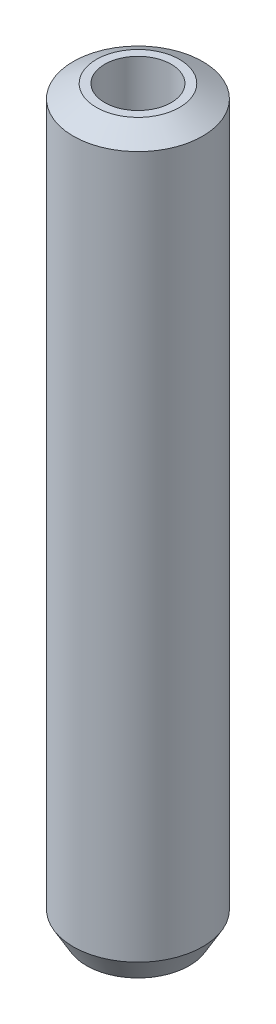
ISO-10303-21;
HEADER;
FILE_DESCRIPTION(('STEP AP214'),'2;1');
FILE_NAME('part.step','',(''),(''),'','','');
FILE_SCHEMA(('AUTOMOTIVE_DESIGN { 1 0 10303 214 1 1 1 1 }'));
ENDSEC;
DATA;
#1=APPLICATION_CONTEXT('core data for automotive mechanical design processes');
#2=APPLICATION_PROTOCOL_DEFINITION('international standard','automotive_design',2000,#1);
#3=PRODUCT_CONTEXT('',#1,'mechanical');
#4=PRODUCT('Part','Part','',(#3));
#5=PRODUCT_RELATED_PRODUCT_CATEGORY('part','',(#4));
#6=PRODUCT_DEFINITION_FORMATION('','',#4);
#7=PRODUCT_DEFINITION_CONTEXT('part definition',#1,'design');
#8=PRODUCT_DEFINITION('design','',#6,#7);
#9=PRODUCT_DEFINITION_SHAPE('','',#8);
#10=(LENGTH_UNIT() NAMED_UNIT(*) SI_UNIT(.MILLI.,.METRE.));
#11=(NAMED_UNIT(*) PLANE_ANGLE_UNIT() SI_UNIT($,.RADIAN.));
#12=(NAMED_UNIT(*) SI_UNIT($,.STERADIAN.) SOLID_ANGLE_UNIT());
#13=UNCERTAINTY_MEASURE_WITH_UNIT(LENGTH_MEASURE(1.E-05),#10,'distance_accuracy_value','');
#14=(GEOMETRIC_REPRESENTATION_CONTEXT(3) GLOBAL_UNCERTAINTY_ASSIGNED_CONTEXT((#13)) GLOBAL_UNIT_ASSIGNED_CONTEXT((#10,
#11,#12)) REPRESENTATION_CONTEXT('',''));
#15=CARTESIAN_POINT('',(0.,0.,0.));
#16=DIRECTION('',(0.,0.,1.));
#17=DIRECTION('',(1.,0.,0.));
#18=AXIS2_PLACEMENT_3D('',#15,#16,#17);
#19=CARTESIAN_POINT('',(0.,228.270910418052,0.));
#20=DIRECTION('',(0.,-1.,0.));
#21=DIRECTION('',(0.,0.,-1.));
#22=AXIS2_PLACEMENT_3D('',#19,#20,#21);
#23=CYLINDRICAL_SURFACE('',#22,20.);
#24=CARTESIAN_POINT('',(0.,224.149492364011,0.));
#25=DIRECTION('',(0.,1.,0.));
#26=DIRECTION('',(0.,0.,1.));
#27=AXIS2_PLACEMENT_3D('',#24,#25,#26);
#28=CIRCLE('',#27,20.);
#29=CARTESIAN_POINT('',(0.,224.149492364011,20.));
#30=VERTEX_POINT('',#29);
#31=EDGE_CURVE('E50',#30,#30,#28,.F.);
#32=ORIENTED_EDGE('',*,*,#31,.T.);
#33=EDGE_LOOP('',(#32));
#34=FACE_BOUND('',#33,.T.);
#35=CARTESIAN_POINT('',(0.,7.13850546883116,0.));
#36=DIRECTION('',(0.,1.,0.));
#37=DIRECTION('',(0.,0.,1.));
#38=AXIS2_PLACEMENT_3D('',#35,#36,#37);
#39=CIRCLE('',#38,20.);
#40=CARTESIAN_POINT('',(0.,7.13850546883116,20.));
#41=VERTEX_POINT('',#40);
#42=EDGE_CURVE('E51',#41,#41,#39,.T.);
#43=ORIENTED_EDGE('',*,*,#42,.T.);
#44=EDGE_LOOP('',(#43));
#45=FACE_BOUND('',#44,.T.);
#46=ADVANCED_FACE('F39',(#34,#45),#23,.T.);
#47=CARTESIAN_POINT('',(0.,228.270910418052,0.));
#48=DIRECTION('',(0.,1.,0.));
#49=DIRECTION('',(0.,0.,1.));
#50=AXIS2_PLACEMENT_3D('',#47,#48,#49);
#51=PLANE('',#50);
#52=CARTESIAN_POINT('',(0.,228.270910418052,0.));
#53=DIRECTION('',(0.,1.,0.));
#54=DIRECTION('',(0.,0.,1.));
#55=AXIS2_PLACEMENT_3D('',#52,#53,#54);
#56=CIRCLE('',#55,12.8614945311689);
#57=CARTESIAN_POINT('',(0.,228.270910418052,12.8614945311689));
#58=VERTEX_POINT('',#57);
#59=EDGE_CURVE('E54',#58,#58,#56,.T.);
#60=ORIENTED_EDGE('',*,*,#59,.T.);
#61=EDGE_LOOP('',(#60));
#62=FACE_BOUND('',#61,.T.);
#63=CARTESIAN_POINT('',(0.,228.270910418052,0.));
#64=DIRECTION('',(0.,1.,0.));
#65=DIRECTION('',(0.,0.,1.));
#66=AXIS2_PLACEMENT_3D('',#63,#64,#65);
#67=CIRCLE('',#66,10.2807044307122);
#68=CARTESIAN_POINT('',(0.,228.270910418052,10.2807044307122));
#69=VERTEX_POINT('',#68);
#70=EDGE_CURVE('E58',#69,#69,#67,.T.);
#71=ORIENTED_EDGE('',*,*,#70,.F.);
#72=EDGE_LOOP('',(#71));
#73=FACE_BOUND('',#72,.T.);
#74=ADVANCED_FACE('F69',(#62,#73),#51,.T.);
#75=CARTESIAN_POINT('',(0.,0.,0.));
#76=DIRECTION('',(0.,1.,0.));
#77=DIRECTION('',(0.,0.,1.));
#78=AXIS2_PLACEMENT_3D('',#75,#76,#77);
#79=PLANE('',#78);
#80=CARTESIAN_POINT('',(0.,0.,0.));
#81=DIRECTION('',(0.,1.,0.));
#82=DIRECTION('',(0.,0.,1.));
#83=AXIS2_PLACEMENT_3D('',#80,#81,#82);
#84=CIRCLE('',#83,15.8785819459587);
#85=CARTESIAN_POINT('',(0.,0.,15.8785819459587));
#86=VERTEX_POINT('',#85);
#87=EDGE_CURVE('E10',#86,#86,#84,.F.);
#88=ORIENTED_EDGE('',*,*,#87,.T.);
#89=EDGE_LOOP('',(#88));
#90=FACE_BOUND('',#89,.T.);
#91=CARTESIAN_POINT('',(0.,0.,0.));
#92=DIRECTION('',(0.,1.,0.));
#93=DIRECTION('',(0.,0.,1.));
#94=AXIS2_PLACEMENT_3D('',#91,#92,#93);
#95=CIRCLE('',#94,10.2807044307122);
#96=CARTESIAN_POINT('',(0.,0.,10.2807044307122));
#97=VERTEX_POINT('',#96);
#98=EDGE_CURVE('E63',#97,#97,#95,.T.);
#99=ORIENTED_EDGE('',*,*,#98,.T.);
#100=EDGE_LOOP('',(#99));
#101=FACE_BOUND('',#100,.T.);
#102=ADVANCED_FACE('F75',(#90,#101),#79,.F.);
#103=CARTESIAN_POINT('',(0.,228.270910418052,0.));
#104=DIRECTION('',(0.,-1.,0.));
#105=DIRECTION('',(0.,0.,-1.));
#106=AXIS2_PLACEMENT_3D('',#103,#104,#105);
#107=CYLINDRICAL_SURFACE('',#106,10.2807044307122);
#108=ORIENTED_EDGE('',*,*,#70,.T.);
#109=EDGE_LOOP('',(#108));
#110=FACE_BOUND('',#109,.T.);
#111=ORIENTED_EDGE('',*,*,#98,.F.);
#112=EDGE_LOOP('',(#111));
#113=FACE_BOUND('',#112,.T.);
#114=ADVANCED_FACE('F70',(#110,#113),#107,.F.);
#115=CARTESIAN_POINT('',(0.,228.270910418052,0.));
#116=DIRECTION('',(0.,-1.,0.));
#117=DIRECTION('',(0.,0.,-1.));
#118=AXIS2_PLACEMENT_3D('',#115,#116,#117);
#119=CONICAL_SURFACE('',#118,12.8614945311689,1.04719755119659);
#120=ORIENTED_EDGE('',*,*,#31,.F.);
#121=EDGE_LOOP('',(#120));
#122=FACE_BOUND('',#121,.T.);
#123=ORIENTED_EDGE('',*,*,#59,.F.);
#124=EDGE_LOOP('',(#123));
#125=FACE_BOUND('',#124,.T.);
#126=ADVANCED_FACE('F81',(#122,#125),#119,.T.);
#127=CARTESIAN_POINT('',(0.,7.13850546883116,0.));
#128=DIRECTION('',(0.,1.,0.));
#129=DIRECTION('',(0.,0.,1.));
#130=AXIS2_PLACEMENT_3D('',#127,#128,#129);
#131=CONICAL_SURFACE('',#130,20.,0.523598775598302);
#132=ORIENTED_EDGE('',*,*,#87,.F.);
#133=EDGE_LOOP('',(#132));
#134=FACE_BOUND('',#133,.T.);
#135=ORIENTED_EDGE('',*,*,#42,.F.);
#136=EDGE_LOOP('',(#135));
#137=FACE_BOUND('',#136,.T.);
#138=ADVANCED_FACE('F45',(#134,#137),#131,.T.);
#139=CLOSED_SHELL('',(#46,#74,#102,#114,#126,#138));
#140=MANIFOLD_SOLID_BREP('B2',#139);
#141=ADVANCED_BREP_SHAPE_REPRESENTATION('',(#18,#140),#14);
#142=SHAPE_DEFINITION_REPRESENTATION(#9,#141);
ENDSEC;
END-ISO-10303-21;
